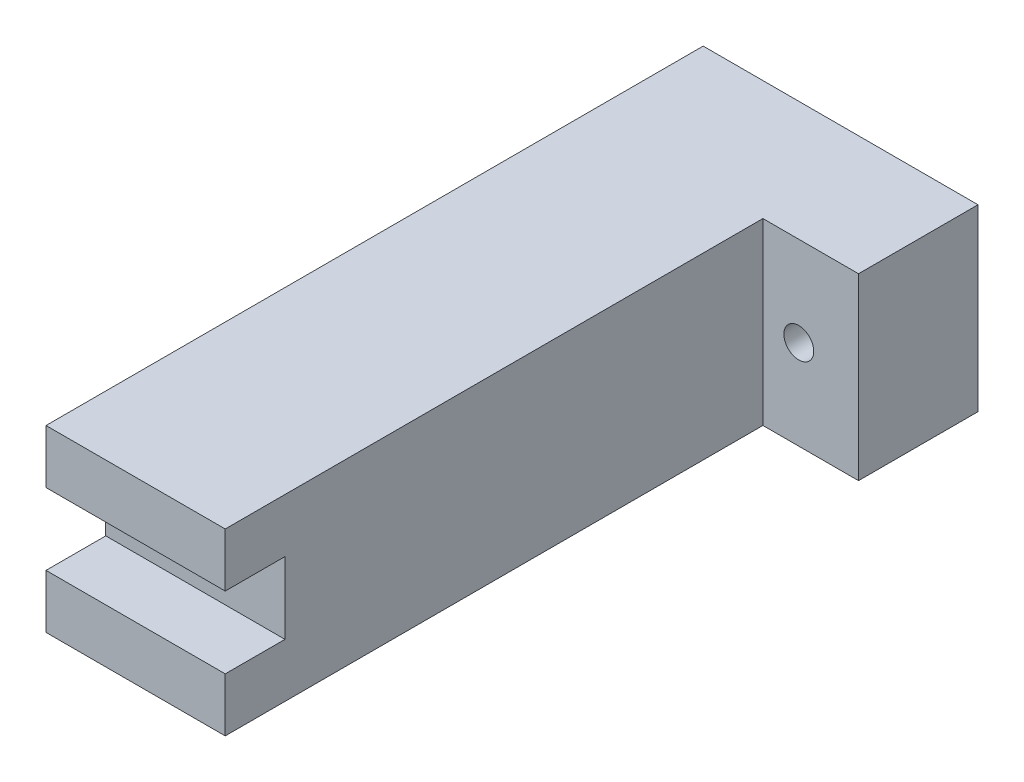
ISO-10303-21;
HEADER;
FILE_DESCRIPTION(('STEP AP214'),'2;1');
FILE_NAME('part.step','',(''),(''),'','','');
FILE_SCHEMA(('AUTOMOTIVE_DESIGN { 1 0 10303 214 1 1 1 1 }'));
ENDSEC;
DATA;
#1=APPLICATION_CONTEXT('core data for automotive mechanical design processes');
#2=APPLICATION_PROTOCOL_DEFINITION('international standard','automotive_design',2000,#1);
#3=PRODUCT_CONTEXT('',#1,'mechanical');
#4=PRODUCT('Part','Part','',(#3));
#5=PRODUCT_RELATED_PRODUCT_CATEGORY('part','',(#4));
#6=PRODUCT_DEFINITION_FORMATION('','',#4);
#7=PRODUCT_DEFINITION_CONTEXT('part definition',#1,'design');
#8=PRODUCT_DEFINITION('design','',#6,#7);
#9=PRODUCT_DEFINITION_SHAPE('','',#8);
#10=(LENGTH_UNIT() NAMED_UNIT(*) SI_UNIT(.MILLI.,.METRE.));
#11=(NAMED_UNIT(*) PLANE_ANGLE_UNIT() SI_UNIT($,.RADIAN.));
#12=(NAMED_UNIT(*) SI_UNIT($,.STERADIAN.) SOLID_ANGLE_UNIT());
#13=UNCERTAINTY_MEASURE_WITH_UNIT(LENGTH_MEASURE(1.E-05),#10,'distance_accuracy_value','');
#14=(GEOMETRIC_REPRESENTATION_CONTEXT(3) GLOBAL_UNCERTAINTY_ASSIGNED_CONTEXT((#13)) GLOBAL_UNIT_ASSIGNED_CONTEXT((#10,
#11,#12)) REPRESENTATION_CONTEXT('',''));
#15=CARTESIAN_POINT('',(0.,0.,0.));
#16=DIRECTION('',(0.,0.,1.));
#17=DIRECTION('',(1.,0.,0.));
#18=AXIS2_PLACEMENT_3D('',#15,#16,#17);
#19=CARTESIAN_POINT('',(-30.,30.,90.));
#20=DIRECTION('',(1.,0.,0.));
#21=DIRECTION('',(0.,0.,-1.));
#22=AXIS2_PLACEMENT_3D('',#19,#20,#21);
#23=PLANE('',#22);
#24=DIRECTION('',(0.,0.,-1.));
#25=VECTOR('',#24,1.);
#26=CARTESIAN_POINT('',(-30.,21.,90.));
#27=LINE('',#26,#25);
#28=CARTESIAN_POINT('',(-30.,21.,90.));
#29=VERTEX_POINT('',#28);
#30=CARTESIAN_POINT('',(-30.,21.,80.));
#31=VERTEX_POINT('',#30);
#32=EDGE_CURVE('E135',#29,#31,#27,.T.);
#33=ORIENTED_EDGE('',*,*,#32,.F.);
#34=DIRECTION('',(0.,-1.,0.));
#35=VECTOR('',#34,1.);
#36=CARTESIAN_POINT('',(-30.,30.,90.));
#37=LINE('',#36,#35);
#38=CARTESIAN_POINT('',(-30.,30.,90.));
#39=VERTEX_POINT('',#38);
#40=EDGE_CURVE('E178',#39,#29,#37,.T.);
#41=ORIENTED_EDGE('',*,*,#40,.F.);
#42=DIRECTION('',(0.,0.,1.));
#43=VECTOR('',#42,1.);
#44=CARTESIAN_POINT('',(-30.,30.,90.));
#45=LINE('',#44,#43);
#46=CARTESIAN_POINT('',(-30.,30.,-20.));
#47=VERTEX_POINT('',#46);
#48=EDGE_CURVE('E152',#47,#39,#45,.T.);
#49=ORIENTED_EDGE('',*,*,#48,.F.);
#50=DIRECTION('',(0.,-1.,0.));
#51=VECTOR('',#50,1.);
#52=CARTESIAN_POINT('',(-30.,30.,-20.));
#53=LINE('',#52,#51);
#54=CARTESIAN_POINT('',(-30.,0.,-20.));
#55=VERTEX_POINT('',#54);
#56=EDGE_CURVE('E181',#47,#55,#53,.T.);
#57=ORIENTED_EDGE('',*,*,#56,.T.);
#58=DIRECTION('',(0.,0.,1.));
#59=VECTOR('',#58,1.);
#60=CARTESIAN_POINT('',(-30.,0.,90.));
#61=LINE('',#60,#59);
#62=CARTESIAN_POINT('',(-30.,0.,90.));
#63=VERTEX_POINT('',#62);
#64=EDGE_CURVE('E165',#55,#63,#61,.T.);
#65=ORIENTED_EDGE('',*,*,#64,.T.);
#66=CARTESIAN_POINT('',(-30.,9.,90.));
#67=VERTEX_POINT('',#66);
#68=EDGE_CURVE('E177',#67,#63,#37,.T.);
#69=ORIENTED_EDGE('',*,*,#68,.F.);
#70=DIRECTION('',(0.,0.,1.));
#71=VECTOR('',#70,1.);
#72=CARTESIAN_POINT('',(-30.,9.,90.));
#73=LINE('',#72,#71);
#74=CARTESIAN_POINT('',(-30.,9.,80.));
#75=VERTEX_POINT('',#74);
#76=EDGE_CURVE('E53',#75,#67,#73,.T.);
#77=ORIENTED_EDGE('',*,*,#76,.F.);
#78=DIRECTION('',(0.,-1.,0.));
#79=VECTOR('',#78,1.);
#80=CARTESIAN_POINT('',(-30.,30.,80.));
#81=LINE('',#80,#79);
#82=EDGE_CURVE('E48',#31,#75,#81,.T.);
#83=ORIENTED_EDGE('',*,*,#82,.F.);
#84=EDGE_LOOP('',(#33,#41,#49,#57,#65,#69,#77,#83));
#85=FACE_BOUND('',#84,.T.);
#86=ADVANCED_FACE('F33',(#85),#23,.F.);
#87=CARTESIAN_POINT('',(0.,30.,90.));
#88=DIRECTION('',(0.,0.,-1.));
#89=DIRECTION('',(-1.,0.,0.));
#90=AXIS2_PLACEMENT_3D('',#87,#88,#89);
#91=PLANE('',#90);
#92=DIRECTION('',(1.,0.,0.));
#93=VECTOR('',#92,1.);
#94=CARTESIAN_POINT('',(-241.183928893037,21.,90.));
#95=LINE('',#94,#93);
#96=CARTESIAN_POINT('',(0.,21.,90.));
#97=VERTEX_POINT('',#96);
#98=EDGE_CURVE('E131',#29,#97,#95,.T.);
#99=ORIENTED_EDGE('',*,*,#98,.T.);
#100=DIRECTION('',(0.,-1.,0.));
#101=VECTOR('',#100,1.);
#102=CARTESIAN_POINT('',(0.,30.,90.));
#103=LINE('',#102,#101);
#104=CARTESIAN_POINT('',(0.,30.,90.));
#105=VERTEX_POINT('',#104);
#106=EDGE_CURVE('E175',#105,#97,#103,.T.);
#107=ORIENTED_EDGE('',*,*,#106,.F.);
#108=DIRECTION('',(1.,0.,0.));
#109=VECTOR('',#108,1.);
#110=CARTESIAN_POINT('',(0.,30.,90.));
#111=LINE('',#110,#109);
#112=EDGE_CURVE('E154',#39,#105,#111,.T.);
#113=ORIENTED_EDGE('',*,*,#112,.F.);
#114=ORIENTED_EDGE('',*,*,#40,.T.);
#115=EDGE_LOOP('',(#99,#107,#113,#114));
#116=FACE_BOUND('',#115,.T.);
#117=ADVANCED_FACE('F216',(#116),#91,.F.);
#118=DIRECTION('',(1.,0.,0.));
#119=VECTOR('',#118,1.);
#120=CARTESIAN_POINT('',(-241.183928893037,9.,90.));
#121=LINE('',#120,#119);
#122=CARTESIAN_POINT('',(0.,9.,90.));
#123=VERTEX_POINT('',#122);
#124=EDGE_CURVE('E122',#67,#123,#121,.T.);
#125=ORIENTED_EDGE('',*,*,#124,.F.);
#126=ORIENTED_EDGE('',*,*,#68,.T.);
#127=DIRECTION('',(1.,0.,0.));
#128=VECTOR('',#127,1.);
#129=CARTESIAN_POINT('',(0.,0.,90.));
#130=LINE('',#129,#128);
#131=CARTESIAN_POINT('',(0.,0.,90.));
#132=VERTEX_POINT('',#131);
#133=EDGE_CURVE('E168',#63,#132,#130,.T.);
#134=ORIENTED_EDGE('',*,*,#133,.T.);
#135=EDGE_CURVE('E174',#123,#132,#103,.T.);
#136=ORIENTED_EDGE('',*,*,#135,.F.);
#137=EDGE_LOOP('',(#125,#126,#134,#136));
#138=FACE_BOUND('',#137,.T.);
#139=ADVANCED_FACE('F214',(#138),#91,.F.);
#140=CARTESIAN_POINT('',(0.,30.,0.));
#141=DIRECTION('',(-1.,0.,0.));
#142=DIRECTION('',(0.,0.,1.));
#143=AXIS2_PLACEMENT_3D('',#140,#141,#142);
#144=PLANE('',#143);
#145=DIRECTION('',(0.,0.,1.));
#146=VECTOR('',#145,1.);
#147=CARTESIAN_POINT('',(0.,21.,0.));
#148=LINE('',#147,#146);
#149=CARTESIAN_POINT('',(0.,21.,80.));
#150=VERTEX_POINT('',#149);
#151=EDGE_CURVE('E11',#150,#97,#148,.T.);
#152=ORIENTED_EDGE('',*,*,#151,.F.);
#153=DIRECTION('',(0.,1.,0.));
#154=VECTOR('',#153,1.);
#155=CARTESIAN_POINT('',(0.,30.,80.));
#156=LINE('',#155,#154);
#157=CARTESIAN_POINT('',(0.,9.,80.));
#158=VERTEX_POINT('',#157);
#159=EDGE_CURVE('E41',#158,#150,#156,.T.);
#160=ORIENTED_EDGE('',*,*,#159,.F.);
#161=DIRECTION('',(0.,0.,-1.));
#162=VECTOR('',#161,1.);
#163=CARTESIAN_POINT('',(0.,9.,0.));
#164=LINE('',#163,#162);
#165=EDGE_CURVE('E110',#123,#158,#164,.T.);
#166=ORIENTED_EDGE('',*,*,#165,.F.);
#167=ORIENTED_EDGE('',*,*,#135,.T.);
#168=DIRECTION('',(0.,0.,-1.));
#169=VECTOR('',#168,1.);
#170=CARTESIAN_POINT('',(0.,0.,0.));
#171=LINE('',#170,#169);
#172=CARTESIAN_POINT('',(0.,0.,0.));
#173=VERTEX_POINT('',#172);
#174=EDGE_CURVE('E148',#132,#173,#171,.T.);
#175=ORIENTED_EDGE('',*,*,#174,.T.);
#176=DIRECTION('',(0.,-1.,0.));
#177=VECTOR('',#176,1.);
#178=CARTESIAN_POINT('',(0.,30.,0.));
#179=LINE('',#178,#177);
#180=CARTESIAN_POINT('',(0.,30.,0.));
#181=VERTEX_POINT('',#180);
#182=EDGE_CURVE('E158',#181,#173,#179,.T.);
#183=ORIENTED_EDGE('',*,*,#182,.F.);
#184=DIRECTION('',(0.,0.,-1.));
#185=VECTOR('',#184,1.);
#186=CARTESIAN_POINT('',(0.,30.,0.));
#187=LINE('',#186,#185);
#188=EDGE_CURVE('E156',#105,#181,#187,.T.);
#189=ORIENTED_EDGE('',*,*,#188,.F.);
#190=ORIENTED_EDGE('',*,*,#106,.T.);
#191=EDGE_LOOP('',(#152,#160,#166,#167,#175,#183,#189,#190));
#192=FACE_BOUND('',#191,.T.);
#193=ADVANCED_FACE('F109',(#192),#144,.F.);
#194=CARTESIAN_POINT('',(16.,30.,0.));
#195=DIRECTION('',(0.,0.,-1.));
#196=DIRECTION('',(-1.,0.,0.));
#197=AXIS2_PLACEMENT_3D('',#194,#195,#196);
#198=PLANE('',#197);
#199=CARTESIAN_POINT('',(6.,15.,0.));
#200=DIRECTION('',(0.,0.,1.));
#201=DIRECTION('',(1.,0.,0.));
#202=AXIS2_PLACEMENT_3D('',#199,#200,#201);
#203=CIRCLE('',#202,2.5);
#204=CARTESIAN_POINT('',(8.5,15.,0.));
#205=VERTEX_POINT('',#204);
#206=EDGE_CURVE('E137',#205,#205,#203,.T.);
#207=ORIENTED_EDGE('',*,*,#206,.F.);
#208=EDGE_LOOP('',(#207));
#209=FACE_BOUND('',#208,.T.);
#210=DIRECTION('',(1.,0.,0.));
#211=VECTOR('',#210,1.);
#212=CARTESIAN_POINT('',(16.,0.,0.));
#213=LINE('',#212,#211);
#214=CARTESIAN_POINT('',(16.,0.,0.));
#215=VERTEX_POINT('',#214);
#216=EDGE_CURVE('E141',#173,#215,#213,.T.);
#217=ORIENTED_EDGE('',*,*,#216,.T.);
#218=DIRECTION('',(0.,-1.,0.));
#219=VECTOR('',#218,1.);
#220=CARTESIAN_POINT('',(16.,30.,0.));
#221=LINE('',#220,#219);
#222=CARTESIAN_POINT('',(16.,30.,0.));
#223=VERTEX_POINT('',#222);
#224=EDGE_CURVE('E123',#223,#215,#221,.T.);
#225=ORIENTED_EDGE('',*,*,#224,.F.);
#226=DIRECTION('',(1.,0.,0.));
#227=VECTOR('',#226,1.);
#228=CARTESIAN_POINT('',(16.,30.,0.));
#229=LINE('',#228,#227);
#230=EDGE_CURVE('E144',#181,#223,#229,.T.);
#231=ORIENTED_EDGE('',*,*,#230,.F.);
#232=ORIENTED_EDGE('',*,*,#182,.T.);
#233=EDGE_LOOP('',(#217,#225,#231,#232));
#234=FACE_BOUND('',#233,.T.);
#235=ADVANCED_FACE('F35',(#209,#234),#198,.F.);
#236=CARTESIAN_POINT('',(16.,30.,-20.));
#237=DIRECTION('',(-1.,0.,0.));
#238=DIRECTION('',(0.,0.,1.));
#239=AXIS2_PLACEMENT_3D('',#236,#237,#238);
#240=PLANE('',#239);
#241=DIRECTION('',(0.,0.,-1.));
#242=VECTOR('',#241,1.);
#243=CARTESIAN_POINT('',(16.,0.,-20.));
#244=LINE('',#243,#242);
#245=CARTESIAN_POINT('',(16.,0.,-20.));
#246=VERTEX_POINT('',#245);
#247=EDGE_CURVE('E161',#215,#246,#244,.T.);
#248=ORIENTED_EDGE('',*,*,#247,.T.);
#249=DIRECTION('',(0.,-1.,0.));
#250=VECTOR('',#249,1.);
#251=CARTESIAN_POINT('',(16.,30.,-20.));
#252=LINE('',#251,#250);
#253=CARTESIAN_POINT('',(16.,30.,-20.));
#254=VERTEX_POINT('',#253);
#255=EDGE_CURVE('E184',#254,#246,#252,.T.);
#256=ORIENTED_EDGE('',*,*,#255,.F.);
#257=DIRECTION('',(0.,0.,-1.));
#258=VECTOR('',#257,1.);
#259=CARTESIAN_POINT('',(16.,30.,-20.));
#260=LINE('',#259,#258);
#261=EDGE_CURVE('E147',#223,#254,#260,.T.);
#262=ORIENTED_EDGE('',*,*,#261,.F.);
#263=ORIENTED_EDGE('',*,*,#224,.T.);
#264=EDGE_LOOP('',(#248,#256,#262,#263));
#265=FACE_BOUND('',#264,.T.);
#266=ADVANCED_FACE('F190',(#265),#240,.F.);
#267=CARTESIAN_POINT('',(-30.,30.,-20.));
#268=DIRECTION('',(0.,0.,1.));
#269=DIRECTION('',(1.,0.,0.));
#270=AXIS2_PLACEMENT_3D('',#267,#268,#269);
#271=PLANE('',#270);
#272=CARTESIAN_POINT('',(6.,15.,-20.));
#273=DIRECTION('',(0.,0.,1.));
#274=DIRECTION('',(1.,0.,0.));
#275=AXIS2_PLACEMENT_3D('',#272,#273,#274);
#276=CIRCLE('',#275,2.5);
#277=CARTESIAN_POINT('',(8.5,15.,-20.));
#278=VERTEX_POINT('',#277);
#279=EDGE_CURVE('E138',#278,#278,#276,.T.);
#280=ORIENTED_EDGE('',*,*,#279,.T.);
#281=EDGE_LOOP('',(#280));
#282=FACE_BOUND('',#281,.T.);
#283=DIRECTION('',(-1.,0.,0.));
#284=VECTOR('',#283,1.);
#285=CARTESIAN_POINT('',(-30.,0.,-20.));
#286=LINE('',#285,#284);
#287=EDGE_CURVE('E163',#246,#55,#286,.T.);
#288=ORIENTED_EDGE('',*,*,#287,.T.);
#289=ORIENTED_EDGE('',*,*,#56,.F.);
#290=DIRECTION('',(-1.,0.,0.));
#291=VECTOR('',#290,1.);
#292=CARTESIAN_POINT('',(-30.,30.,-20.));
#293=LINE('',#292,#291);
#294=EDGE_CURVE('E150',#254,#47,#293,.T.);
#295=ORIENTED_EDGE('',*,*,#294,.F.);
#296=ORIENTED_EDGE('',*,*,#255,.T.);
#297=EDGE_LOOP('',(#288,#289,#295,#296));
#298=FACE_BOUND('',#297,.T.);
#299=ADVANCED_FACE('F204',(#282,#298),#271,.F.);
#300=CARTESIAN_POINT('',(0.,30.,0.));
#301=DIRECTION('',(0.,1.,0.));
#302=DIRECTION('',(0.,0.,1.));
#303=AXIS2_PLACEMENT_3D('',#300,#301,#302);
#304=PLANE('',#303);
#305=ORIENTED_EDGE('',*,*,#230,.T.);
#306=ORIENTED_EDGE('',*,*,#261,.T.);
#307=ORIENTED_EDGE('',*,*,#294,.T.);
#308=ORIENTED_EDGE('',*,*,#48,.T.);
#309=ORIENTED_EDGE('',*,*,#112,.T.);
#310=ORIENTED_EDGE('',*,*,#188,.T.);
#311=EDGE_LOOP('',(#305,#306,#307,#308,#309,#310));
#312=FACE_BOUND('',#311,.T.);
#313=ADVANCED_FACE('F210',(#312),#304,.T.);
#314=CARTESIAN_POINT('',(0.,0.,0.));
#315=DIRECTION('',(0.,1.,0.));
#316=DIRECTION('',(0.,0.,1.));
#317=AXIS2_PLACEMENT_3D('',#314,#315,#316);
#318=PLANE('',#317);
#319=ORIENTED_EDGE('',*,*,#216,.F.);
#320=ORIENTED_EDGE('',*,*,#174,.F.);
#321=ORIENTED_EDGE('',*,*,#133,.F.);
#322=ORIENTED_EDGE('',*,*,#64,.F.);
#323=ORIENTED_EDGE('',*,*,#287,.F.);
#324=ORIENTED_EDGE('',*,*,#247,.F.);
#325=EDGE_LOOP('',(#319,#320,#321,#322,#323,#324));
#326=FACE_BOUND('',#325,.T.);
#327=ADVANCED_FACE('F198',(#326),#318,.F.);
#328=CARTESIAN_POINT('',(6.,15.,-20.));
#329=DIRECTION('',(0.,0.,1.));
#330=DIRECTION('',(1.,0.,0.));
#331=AXIS2_PLACEMENT_3D('',#328,#329,#330);
#332=CYLINDRICAL_SURFACE('',#331,2.5);
#333=ORIENTED_EDGE('',*,*,#279,.F.);
#334=EDGE_LOOP('',(#333));
#335=FACE_BOUND('',#334,.T.);
#336=ORIENTED_EDGE('',*,*,#206,.T.);
#337=EDGE_LOOP('',(#336));
#338=FACE_BOUND('',#337,.T.);
#339=ADVANCED_FACE('F240',(#335,#338),#332,.F.);
#340=CARTESIAN_POINT('',(-241.183928893037,21.,90.));
#341=DIRECTION('',(0.,-1.,0.));
#342=DIRECTION('',(0.,0.,-1.));
#343=AXIS2_PLACEMENT_3D('',#340,#341,#342);
#344=PLANE('',#343);
#345=ORIENTED_EDGE('',*,*,#98,.F.);
#346=ORIENTED_EDGE('',*,*,#32,.T.);
#347=DIRECTION('',(1.,0.,0.));
#348=VECTOR('',#347,1.);
#349=CARTESIAN_POINT('',(-241.183928893037,21.,80.));
#350=LINE('',#349,#348);
#351=EDGE_CURVE('E127',#31,#150,#350,.T.);
#352=ORIENTED_EDGE('',*,*,#351,.T.);
#353=ORIENTED_EDGE('',*,*,#151,.T.);
#354=EDGE_LOOP('',(#345,#346,#352,#353));
#355=FACE_BOUND('',#354,.T.);
#356=ADVANCED_FACE('F242',(#355),#344,.T.);
#357=CARTESIAN_POINT('',(-241.183928893037,21.,80.));
#358=DIRECTION('',(0.,0.,1.));
#359=DIRECTION('',(1.,0.,0.));
#360=AXIS2_PLACEMENT_3D('',#357,#358,#359);
#361=PLANE('',#360);
#362=ORIENTED_EDGE('',*,*,#351,.F.);
#363=ORIENTED_EDGE('',*,*,#82,.T.);
#364=DIRECTION('',(1.,0.,0.));
#365=VECTOR('',#364,1.);
#366=CARTESIAN_POINT('',(-241.183928893037,9.,80.));
#367=LINE('',#366,#365);
#368=EDGE_CURVE('E121',#75,#158,#367,.T.);
#369=ORIENTED_EDGE('',*,*,#368,.T.);
#370=ORIENTED_EDGE('',*,*,#159,.T.);
#371=EDGE_LOOP('',(#362,#363,#369,#370));
#372=FACE_BOUND('',#371,.T.);
#373=ADVANCED_FACE('F125',(#372),#361,.T.);
#374=CARTESIAN_POINT('',(-241.183928893037,9.,80.));
#375=DIRECTION('',(0.,1.,0.));
#376=DIRECTION('',(0.,0.,1.));
#377=AXIS2_PLACEMENT_3D('',#374,#375,#376);
#378=PLANE('',#377);
#379=ORIENTED_EDGE('',*,*,#368,.F.);
#380=ORIENTED_EDGE('',*,*,#76,.T.);
#381=ORIENTED_EDGE('',*,*,#124,.T.);
#382=ORIENTED_EDGE('',*,*,#165,.T.);
#383=EDGE_LOOP('',(#379,#380,#381,#382));
#384=FACE_BOUND('',#383,.T.);
#385=ADVANCED_FACE('F120',(#384),#378,.T.);
#386=CLOSED_SHELL('',(#86,#117,#139,#193,#235,#266,#299,#313,#327,#339,#356,#373,#385));
#387=MANIFOLD_SOLID_BREP('B2',#386);
#388=ADVANCED_BREP_SHAPE_REPRESENTATION('',(#18,#387),#14);
#389=SHAPE_DEFINITION_REPRESENTATION(#9,#388);
ENDSEC;
END-ISO-10303-21;
